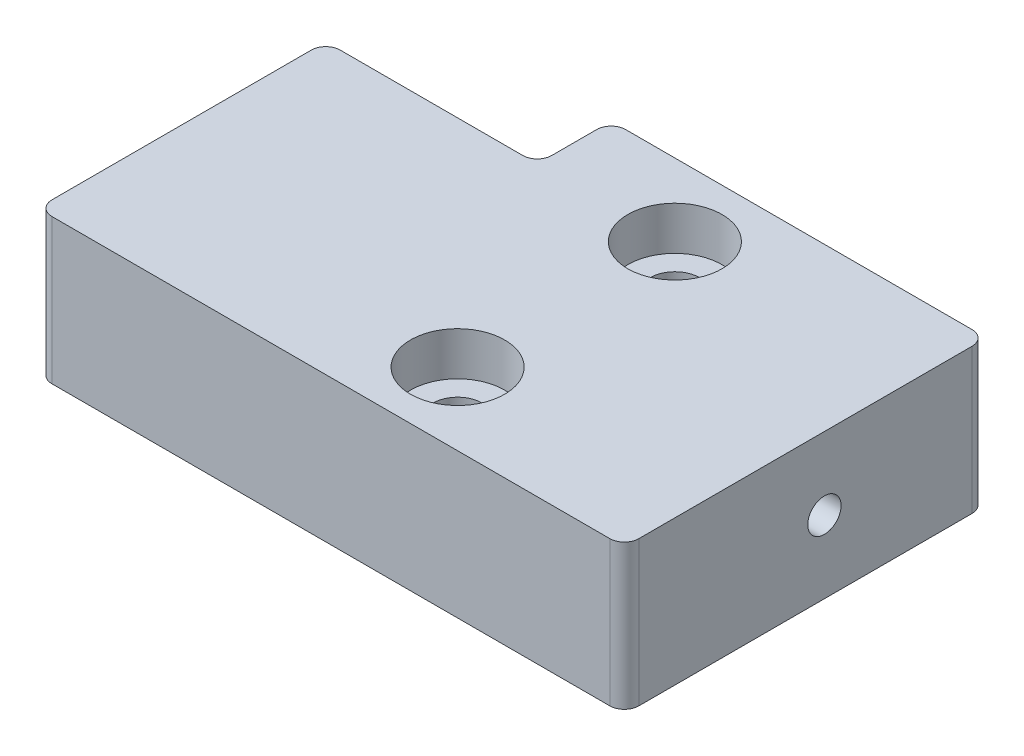
ISO-10303-21;
HEADER;
FILE_DESCRIPTION(('STEP AP214'),'2;1');
FILE_NAME('part.step','',(''),(''),'','','');
FILE_SCHEMA(('AUTOMOTIVE_DESIGN { 1 0 10303 214 1 1 1 1 }'));
ENDSEC;
DATA;
#1=APPLICATION_CONTEXT('core data for automotive mechanical design processes');
#2=APPLICATION_PROTOCOL_DEFINITION('international standard','automotive_design',2000,#1);
#3=PRODUCT_CONTEXT('',#1,'mechanical');
#4=PRODUCT('Part','Part','',(#3));
#5=PRODUCT_RELATED_PRODUCT_CATEGORY('part','',(#4));
#6=PRODUCT_DEFINITION_FORMATION('','',#4);
#7=PRODUCT_DEFINITION_CONTEXT('part definition',#1,'design');
#8=PRODUCT_DEFINITION('design','',#6,#7);
#9=PRODUCT_DEFINITION_SHAPE('','',#8);
#10=(LENGTH_UNIT() NAMED_UNIT(*) SI_UNIT(.MILLI.,.METRE.));
#11=(NAMED_UNIT(*) PLANE_ANGLE_UNIT() SI_UNIT($,.RADIAN.));
#12=(NAMED_UNIT(*) SI_UNIT($,.STERADIAN.) SOLID_ANGLE_UNIT());
#13=UNCERTAINTY_MEASURE_WITH_UNIT(LENGTH_MEASURE(1.E-05),#10,'distance_accuracy_value','');
#14=(GEOMETRIC_REPRESENTATION_CONTEXT(3) GLOBAL_UNCERTAINTY_ASSIGNED_CONTEXT((#13)) GLOBAL_UNIT_ASSIGNED_CONTEXT((#10,
#11,#12)) REPRESENTATION_CONTEXT('',''));
#15=CARTESIAN_POINT('',(0.,0.,0.));
#16=DIRECTION('',(0.,0.,1.));
#17=DIRECTION('',(1.,0.,0.));
#18=AXIS2_PLACEMENT_3D('',#15,#16,#17);
#19=CARTESIAN_POINT('',(0.,10.,-19.9));
#20=DIRECTION('',(1.,0.,0.));
#21=DIRECTION('',(0.,0.,-1.));
#22=AXIS2_PLACEMENT_3D('',#19,#20,#21);
#23=PLANE('',#22);
#24=DIRECTION('',(0.,0.,1.));
#25=VECTOR('',#24,1.);
#26=CARTESIAN_POINT('',(0.,10.,-19.9));
#27=LINE('',#26,#25);
#28=CARTESIAN_POINT('',(0.,10.,-18.9));
#29=VERTEX_POINT('',#28);
#30=CARTESIAN_POINT('',(0.,10.,-1.00000000000001));
#31=VERTEX_POINT('',#30);
#32=EDGE_CURVE('E150',#29,#31,#27,.T.);
#33=ORIENTED_EDGE('',*,*,#32,.F.);
#34=DIRECTION('',(0.,-1.,0.));
#35=VECTOR('',#34,1.);
#36=CARTESIAN_POINT('',(0.,10.,-18.9));
#37=LINE('',#36,#35);
#38=CARTESIAN_POINT('',(0.,0.,-18.9));
#39=VERTEX_POINT('',#38);
#40=EDGE_CURVE('E135',#29,#39,#37,.T.);
#41=ORIENTED_EDGE('',*,*,#40,.T.);
#42=DIRECTION('',(0.,0.,1.));
#43=VECTOR('',#42,1.);
#44=CARTESIAN_POINT('',(0.,0.,-19.9));
#45=LINE('',#44,#43);
#46=CARTESIAN_POINT('',(0.,0.,-1.00000000000001));
#47=VERTEX_POINT('',#46);
#48=EDGE_CURVE('E147',#39,#47,#45,.T.);
#49=ORIENTED_EDGE('',*,*,#48,.T.);
#50=DIRECTION('',(0.,-1.,0.));
#51=VECTOR('',#50,1.);
#52=CARTESIAN_POINT('',(0.,10.,-1.));
#53=LINE('',#52,#51);
#54=EDGE_CURVE('E152',#47,#31,#53,.F.);
#55=ORIENTED_EDGE('',*,*,#54,.T.);
#56=EDGE_LOOP('',(#33,#41,#49,#55));
#57=FACE_BOUND('',#56,.T.);
#58=ADVANCED_FACE('F40',(#57),#23,.F.);
#59=CARTESIAN_POINT('',(0.,10.,0.));
#60=DIRECTION('',(0.,0.,-1.));
#61=DIRECTION('',(-1.,0.,0.));
#62=AXIS2_PLACEMENT_3D('',#59,#60,#61);
#63=PLANE('',#62);
#64=DIRECTION('',(1.,0.,0.));
#65=VECTOR('',#64,1.);
#66=CARTESIAN_POINT('',(0.,0.,0.));
#67=LINE('',#66,#65);
#68=CARTESIAN_POINT('',(1.,0.,0.));
#69=VERTEX_POINT('',#68);
#70=CARTESIAN_POINT('',(39.51,0.,0.));
#71=VERTEX_POINT('',#70);
#72=EDGE_CURVE('E156',#69,#71,#67,.T.);
#73=ORIENTED_EDGE('',*,*,#72,.T.);
#74=DIRECTION('',(0.,-1.,0.));
#75=VECTOR('',#74,1.);
#76=CARTESIAN_POINT('',(39.51,10.,0.));
#77=LINE('',#76,#75);
#78=CARTESIAN_POINT('',(39.51,10.,0.));
#79=VERTEX_POINT('',#78);
#80=EDGE_CURVE('E214',#71,#79,#77,.F.);
#81=ORIENTED_EDGE('',*,*,#80,.T.);
#82=DIRECTION('',(1.,0.,0.));
#83=VECTOR('',#82,1.);
#84=CARTESIAN_POINT('',(0.,10.,0.));
#85=LINE('',#84,#83);
#86=CARTESIAN_POINT('',(1.,10.,0.));
#87=VERTEX_POINT('',#86);
#88=EDGE_CURVE('E235',#87,#79,#85,.T.);
#89=ORIENTED_EDGE('',*,*,#88,.F.);
#90=DIRECTION('',(0.,-1.,0.));
#91=VECTOR('',#90,1.);
#92=CARTESIAN_POINT('',(1.,10.,0.));
#93=LINE('',#92,#91);
#94=EDGE_CURVE('E211',#87,#69,#93,.T.);
#95=ORIENTED_EDGE('',*,*,#94,.T.);
#96=EDGE_LOOP('',(#73,#81,#89,#95));
#97=FACE_BOUND('',#96,.T.);
#98=ADVANCED_FACE('F284',(#97),#63,.F.);
#99=CARTESIAN_POINT('',(40.51,10.,0.));
#100=DIRECTION('',(-1.,0.,0.));
#101=DIRECTION('',(0.,0.,1.));
#102=AXIS2_PLACEMENT_3D('',#99,#100,#101);
#103=PLANE('',#102);
#104=CARTESIAN_POINT('',(40.51,4.99999999999972,-13.8099999999999));
#105=DIRECTION('',(-1.,0.,0.));
#106=DIRECTION('',(0.,0.,1.));
#107=AXIS2_PLACEMENT_3D('',#104,#105,#106);
#108=CIRCLE('',#107,1.15);
#109=CARTESIAN_POINT('',(40.51,4.99999999999972,-12.6599999999999));
#110=VERTEX_POINT('',#109);
#111=EDGE_CURVE('E44',#110,#110,#108,.T.);
#112=ORIENTED_EDGE('',*,*,#111,.T.);
#113=EDGE_LOOP('',(#112));
#114=FACE_BOUND('',#113,.T.);
#115=DIRECTION('',(0.,0.,-1.));
#116=VECTOR('',#115,1.);
#117=CARTESIAN_POINT('',(40.51,0.,0.));
#118=LINE('',#117,#116);
#119=CARTESIAN_POINT('',(40.51,0.,-1.));
#120=VERTEX_POINT('',#119);
#121=CARTESIAN_POINT('',(40.51,0.,-24.));
#122=VERTEX_POINT('',#121);
#123=EDGE_CURVE('E160',#120,#122,#118,.T.);
#124=ORIENTED_EDGE('',*,*,#123,.T.);
#125=DIRECTION('',(0.,-1.,0.));
#126=VECTOR('',#125,1.);
#127=CARTESIAN_POINT('',(40.51,10.,-24.));
#128=LINE('',#127,#126);
#129=CARTESIAN_POINT('',(40.51,10.,-24.));
#130=VERTEX_POINT('',#129);
#131=EDGE_CURVE('E209',#122,#130,#128,.F.);
#132=ORIENTED_EDGE('',*,*,#131,.T.);
#133=DIRECTION('',(0.,0.,-1.));
#134=VECTOR('',#133,1.);
#135=CARTESIAN_POINT('',(40.51,10.,0.));
#136=LINE('',#135,#134);
#137=CARTESIAN_POINT('',(40.51,10.,-1.));
#138=VERTEX_POINT('',#137);
#139=EDGE_CURVE('E230',#138,#130,#136,.T.);
#140=ORIENTED_EDGE('',*,*,#139,.F.);
#141=DIRECTION('',(0.,-1.,0.));
#142=VECTOR('',#141,1.);
#143=CARTESIAN_POINT('',(40.51,10.,-1.));
#144=LINE('',#143,#142);
#145=EDGE_CURVE('E206',#138,#120,#144,.T.);
#146=ORIENTED_EDGE('',*,*,#145,.T.);
#147=EDGE_LOOP('',(#124,#132,#140,#146));
#148=FACE_BOUND('',#147,.T.);
#149=ADVANCED_FACE('F266',(#114,#148),#103,.F.);
#150=CARTESIAN_POINT('',(40.51,10.,-25.));
#151=DIRECTION('',(0.,0.,1.));
#152=DIRECTION('',(1.,0.,0.));
#153=AXIS2_PLACEMENT_3D('',#150,#151,#152);
#154=PLANE('',#153);
#155=DIRECTION('',(-1.,0.,0.));
#156=VECTOR('',#155,1.);
#157=CARTESIAN_POINT('',(40.51,0.,-25.));
#158=LINE('',#157,#156);
#159=CARTESIAN_POINT('',(39.51,0.,-25.));
#160=VERTEX_POINT('',#159);
#161=CARTESIAN_POINT('',(15.6,0.,-25.));
#162=VERTEX_POINT('',#161);
#163=EDGE_CURVE('E171',#160,#162,#158,.T.);
#164=ORIENTED_EDGE('',*,*,#163,.T.);
#165=DIRECTION('',(0.,-1.,0.));
#166=VECTOR('',#165,1.);
#167=CARTESIAN_POINT('',(15.6,10.,-25.));
#168=LINE('',#167,#166);
#169=CARTESIAN_POINT('',(15.6,10.,-25.));
#170=VERTEX_POINT('',#169);
#171=EDGE_CURVE('E204',#162,#170,#168,.F.);
#172=ORIENTED_EDGE('',*,*,#171,.T.);
#173=DIRECTION('',(-1.,0.,0.));
#174=VECTOR('',#173,1.);
#175=CARTESIAN_POINT('',(40.51,10.,-25.));
#176=LINE('',#175,#174);
#177=CARTESIAN_POINT('',(39.51,10.,-25.));
#178=VERTEX_POINT('',#177);
#179=EDGE_CURVE('E229',#178,#170,#176,.T.);
#180=ORIENTED_EDGE('',*,*,#179,.F.);
#181=DIRECTION('',(0.,-1.,0.));
#182=VECTOR('',#181,1.);
#183=CARTESIAN_POINT('',(39.51,10.,-25.));
#184=LINE('',#183,#182);
#185=EDGE_CURVE('E201',#178,#160,#184,.T.);
#186=ORIENTED_EDGE('',*,*,#185,.T.);
#187=EDGE_LOOP('',(#164,#172,#180,#186));
#188=FACE_BOUND('',#187,.T.);
#189=ADVANCED_FACE('F323',(#188),#154,.F.);
#190=CARTESIAN_POINT('',(14.6,10.,-25.));
#191=DIRECTION('',(1.,0.,0.));
#192=DIRECTION('',(0.,0.,-1.));
#193=AXIS2_PLACEMENT_3D('',#190,#191,#192);
#194=PLANE('',#193);
#195=DIRECTION('',(0.,0.,1.));
#196=VECTOR('',#195,1.);
#197=CARTESIAN_POINT('',(14.6,0.,-25.));
#198=LINE('',#197,#196);
#199=CARTESIAN_POINT('',(14.6,0.,-24.));
#200=VERTEX_POINT('',#199);
#201=CARTESIAN_POINT('',(14.6,0.,-20.9));
#202=VERTEX_POINT('',#201);
#203=EDGE_CURVE('E174',#200,#202,#198,.T.);
#204=ORIENTED_EDGE('',*,*,#203,.T.);
#205=DIRECTION('',(0.,-1.,0.));
#206=VECTOR('',#205,1.);
#207=CARTESIAN_POINT('',(14.6,10.,-20.9));
#208=LINE('',#207,#206);
#209=CARTESIAN_POINT('',(14.6,10.,-20.9));
#210=VERTEX_POINT('',#209);
#211=EDGE_CURVE('E56',#202,#210,#208,.F.);
#212=ORIENTED_EDGE('',*,*,#211,.T.);
#213=DIRECTION('',(0.,0.,1.));
#214=VECTOR('',#213,1.);
#215=CARTESIAN_POINT('',(14.6,10.,-25.));
#216=LINE('',#215,#214);
#217=CARTESIAN_POINT('',(14.6,10.,-24.));
#218=VERTEX_POINT('',#217);
#219=EDGE_CURVE('E226',#218,#210,#216,.T.);
#220=ORIENTED_EDGE('',*,*,#219,.F.);
#221=DIRECTION('',(0.,-1.,0.));
#222=VECTOR('',#221,1.);
#223=CARTESIAN_POINT('',(14.6,10.,-24.));
#224=LINE('',#223,#222);
#225=EDGE_CURVE('E197',#218,#200,#224,.T.);
#226=ORIENTED_EDGE('',*,*,#225,.T.);
#227=EDGE_LOOP('',(#204,#212,#220,#226));
#228=FACE_BOUND('',#227,.T.);
#229=ADVANCED_FACE('F219',(#228),#194,.F.);
#230=CARTESIAN_POINT('',(14.6,10.,-19.9));
#231=DIRECTION('',(0.,0.,1.));
#232=DIRECTION('',(1.,0.,0.));
#233=AXIS2_PLACEMENT_3D('',#230,#231,#232);
#234=PLANE('',#233);
#235=DIRECTION('',(-1.,0.,0.));
#236=VECTOR('',#235,1.);
#237=CARTESIAN_POINT('',(14.6,0.,-19.9));
#238=LINE('',#237,#236);
#239=CARTESIAN_POINT('',(13.6,0.,-19.9));
#240=VERTEX_POINT('',#239);
#241=CARTESIAN_POINT('',(0.999999999999997,0.,-19.9));
#242=VERTEX_POINT('',#241);
#243=EDGE_CURVE('E176',#240,#242,#238,.T.);
#244=ORIENTED_EDGE('',*,*,#243,.T.);
#245=DIRECTION('',(0.,-1.,0.));
#246=VECTOR('',#245,1.);
#247=CARTESIAN_POINT('',(0.999999999999997,10.,-19.9));
#248=LINE('',#247,#246);
#249=CARTESIAN_POINT('',(0.999999999999997,10.,-19.9));
#250=VERTEX_POINT('',#249);
#251=EDGE_CURVE('E136',#242,#250,#248,.F.);
#252=ORIENTED_EDGE('',*,*,#251,.T.);
#253=DIRECTION('',(-1.,0.,0.));
#254=VECTOR('',#253,1.);
#255=CARTESIAN_POINT('',(14.6,10.,-19.9));
#256=LINE('',#255,#254);
#257=CARTESIAN_POINT('',(13.6,10.,-19.9));
#258=VERTEX_POINT('',#257);
#259=EDGE_CURVE('E166',#258,#250,#256,.T.);
#260=ORIENTED_EDGE('',*,*,#259,.F.);
#261=DIRECTION('',(0.,-1.,0.));
#262=VECTOR('',#261,1.);
#263=CARTESIAN_POINT('',(13.6,0.,-19.9));
#264=LINE('',#263,#262);
#265=EDGE_CURVE('E141',#258,#240,#264,.T.);
#266=ORIENTED_EDGE('',*,*,#265,.T.);
#267=EDGE_LOOP('',(#244,#252,#260,#266));
#268=FACE_BOUND('',#267,.T.);
#269=ADVANCED_FACE('F228',(#268),#234,.F.);
#270=CARTESIAN_POINT('',(0.,10.,0.));
#271=DIRECTION('',(0.,1.,0.));
#272=DIRECTION('',(0.,0.,1.));
#273=AXIS2_PLACEMENT_3D('',#270,#271,#272);
#274=PLANE('',#273);
#275=CARTESIAN_POINT('',(24.,10.,-20.));
#276=DIRECTION('',(0.,1.,0.));
#277=DIRECTION('',(0.,0.,1.));
#278=AXIS2_PLACEMENT_3D('',#275,#276,#277);
#279=CIRCLE('',#278,3.25);
#280=CARTESIAN_POINT('',(24.,10.,-16.75));
#281=VERTEX_POINT('',#280);
#282=EDGE_CURVE('E256',#281,#281,#279,.T.);
#283=ORIENTED_EDGE('',*,*,#282,.F.);
#284=EDGE_LOOP('',(#283));
#285=FACE_BOUND('',#284,.T.);
#286=CARTESIAN_POINT('',(24.,10.,-5.));
#287=DIRECTION('',(0.,1.,0.));
#288=DIRECTION('',(0.,0.,1.));
#289=AXIS2_PLACEMENT_3D('',#286,#287,#288);
#290=CIRCLE('',#289,3.25);
#291=CARTESIAN_POINT('',(24.,10.,-1.75000000000001));
#292=VERTEX_POINT('',#291);
#293=EDGE_CURVE('E244',#292,#292,#290,.T.);
#294=ORIENTED_EDGE('',*,*,#293,.F.);
#295=EDGE_LOOP('',(#294));
#296=FACE_BOUND('',#295,.T.);
#297=ORIENTED_EDGE('',*,*,#259,.T.);
#298=CARTESIAN_POINT('',(0.999999999999998,10.,-18.9));
#299=DIRECTION('',(0.,1.,0.));
#300=DIRECTION('',(0.,0.,1.));
#301=AXIS2_PLACEMENT_3D('',#298,#299,#300);
#302=CIRCLE('',#301,1.);
#303=EDGE_CURVE('E195',#250,#29,#302,.T.);
#304=ORIENTED_EDGE('',*,*,#303,.T.);
#305=ORIENTED_EDGE('',*,*,#32,.T.);
#306=CARTESIAN_POINT('',(1.,10.,-1.));
#307=DIRECTION('',(0.,1.,0.));
#308=DIRECTION('',(0.,0.,1.));
#309=AXIS2_PLACEMENT_3D('',#306,#307,#308);
#310=CIRCLE('',#309,1.);
#311=EDGE_CURVE('E188',#31,#87,#310,.T.);
#312=ORIENTED_EDGE('',*,*,#311,.T.);
#313=ORIENTED_EDGE('',*,*,#88,.T.);
#314=CARTESIAN_POINT('',(39.51,10.,-1.));
#315=DIRECTION('',(0.,1.,0.));
#316=DIRECTION('',(0.,0.,1.));
#317=AXIS2_PLACEMENT_3D('',#314,#315,#316);
#318=CIRCLE('',#317,1.);
#319=EDGE_CURVE('E190',#79,#138,#318,.T.);
#320=ORIENTED_EDGE('',*,*,#319,.T.);
#321=ORIENTED_EDGE('',*,*,#139,.T.);
#322=CARTESIAN_POINT('',(39.51,10.,-24.));
#323=DIRECTION('',(0.,1.,0.));
#324=DIRECTION('',(0.,0.,1.));
#325=AXIS2_PLACEMENT_3D('',#322,#323,#324);
#326=CIRCLE('',#325,1.);
#327=EDGE_CURVE('E192',#130,#178,#326,.T.);
#328=ORIENTED_EDGE('',*,*,#327,.T.);
#329=ORIENTED_EDGE('',*,*,#179,.T.);
#330=CARTESIAN_POINT('',(15.6,10.,-24.));
#331=DIRECTION('',(0.,1.,0.));
#332=DIRECTION('',(0.,0.,1.));
#333=AXIS2_PLACEMENT_3D('',#330,#331,#332);
#334=CIRCLE('',#333,1.);
#335=EDGE_CURVE('E63',#170,#218,#334,.T.);
#336=ORIENTED_EDGE('',*,*,#335,.T.);
#337=ORIENTED_EDGE('',*,*,#219,.T.);
#338=CARTESIAN_POINT('',(13.6,10.,-20.9));
#339=DIRECTION('',(0.,1.,0.));
#340=DIRECTION('',(0.,0.,1.));
#341=AXIS2_PLACEMENT_3D('',#338,#339,#340);
#342=CIRCLE('',#341,1.);
#343=EDGE_CURVE('E11',#210,#258,#342,.F.);
#344=ORIENTED_EDGE('',*,*,#343,.T.);
#345=EDGE_LOOP('',(#297,#304,#305,#312,#313,#320,#321,#328,#329,#336,#337,#344));
#346=FACE_BOUND('',#345,.T.);
#347=ADVANCED_FACE('F225',(#285,#296,#346),#274,.T.);
#348=CARTESIAN_POINT('',(0.,0.,0.));
#349=DIRECTION('',(0.,1.,0.));
#350=DIRECTION('',(0.,0.,1.));
#351=AXIS2_PLACEMENT_3D('',#348,#349,#350);
#352=PLANE('',#351);
#353=CARTESIAN_POINT('',(24.,0.,-20.));
#354=DIRECTION('',(0.,1.,0.));
#355=DIRECTION('',(0.,0.,1.));
#356=AXIS2_PLACEMENT_3D('',#353,#354,#355);
#357=CIRCLE('',#356,1.7);
#358=CARTESIAN_POINT('',(24.,0.,-18.3));
#359=VERTEX_POINT('',#358);
#360=EDGE_CURVE('E247',#359,#359,#357,.T.);
#361=ORIENTED_EDGE('',*,*,#360,.T.);
#362=EDGE_LOOP('',(#361));
#363=FACE_BOUND('',#362,.T.);
#364=CARTESIAN_POINT('',(24.,0.,-5.));
#365=DIRECTION('',(0.,1.,0.));
#366=DIRECTION('',(0.,0.,1.));
#367=AXIS2_PLACEMENT_3D('',#364,#365,#366);
#368=CIRCLE('',#367,1.7);
#369=CARTESIAN_POINT('',(24.,0.,-3.3));
#370=VERTEX_POINT('',#369);
#371=EDGE_CURVE('E157',#370,#370,#368,.T.);
#372=ORIENTED_EDGE('',*,*,#371,.T.);
#373=EDGE_LOOP('',(#372));
#374=FACE_BOUND('',#373,.T.);
#375=ORIENTED_EDGE('',*,*,#48,.F.);
#376=CARTESIAN_POINT('',(0.999999999999998,0.,-18.9));
#377=DIRECTION('',(0.,1.,0.));
#378=DIRECTION('',(0.,0.,1.));
#379=AXIS2_PLACEMENT_3D('',#376,#377,#378);
#380=CIRCLE('',#379,1.);
#381=EDGE_CURVE('E131',#39,#242,#380,.F.);
#382=ORIENTED_EDGE('',*,*,#381,.T.);
#383=ORIENTED_EDGE('',*,*,#243,.F.);
#384=CARTESIAN_POINT('',(13.6,0.,-20.9));
#385=DIRECTION('',(0.,1.,0.));
#386=DIRECTION('',(0.,0.,1.));
#387=AXIS2_PLACEMENT_3D('',#384,#385,#386);
#388=CIRCLE('',#387,1.);
#389=EDGE_CURVE('E49',#240,#202,#388,.T.);
#390=ORIENTED_EDGE('',*,*,#389,.T.);
#391=ORIENTED_EDGE('',*,*,#203,.F.);
#392=CARTESIAN_POINT('',(15.6,0.,-24.));
#393=DIRECTION('',(0.,1.,0.));
#394=DIRECTION('',(0.,0.,1.));
#395=AXIS2_PLACEMENT_3D('',#392,#393,#394);
#396=CIRCLE('',#395,1.);
#397=EDGE_CURVE('E142',#200,#162,#396,.F.);
#398=ORIENTED_EDGE('',*,*,#397,.T.);
#399=ORIENTED_EDGE('',*,*,#163,.F.);
#400=CARTESIAN_POINT('',(39.51,0.,-24.));
#401=DIRECTION('',(0.,1.,0.));
#402=DIRECTION('',(0.,0.,1.));
#403=AXIS2_PLACEMENT_3D('',#400,#401,#402);
#404=CIRCLE('',#403,1.);
#405=EDGE_CURVE('E182',#160,#122,#404,.F.);
#406=ORIENTED_EDGE('',*,*,#405,.T.);
#407=ORIENTED_EDGE('',*,*,#123,.F.);
#408=CARTESIAN_POINT('',(39.51,0.,-1.));
#409=DIRECTION('',(0.,1.,0.));
#410=DIRECTION('',(0.,0.,1.));
#411=AXIS2_PLACEMENT_3D('',#408,#409,#410);
#412=CIRCLE('',#411,1.);
#413=EDGE_CURVE('E180',#120,#71,#412,.F.);
#414=ORIENTED_EDGE('',*,*,#413,.T.);
#415=ORIENTED_EDGE('',*,*,#72,.F.);
#416=CARTESIAN_POINT('',(1.,0.,-1.));
#417=DIRECTION('',(0.,1.,0.));
#418=DIRECTION('',(0.,0.,1.));
#419=AXIS2_PLACEMENT_3D('',#416,#417,#418);
#420=CIRCLE('',#419,1.);
#421=EDGE_CURVE('E151',#69,#47,#420,.F.);
#422=ORIENTED_EDGE('',*,*,#421,.T.);
#423=EDGE_LOOP('',(#375,#382,#383,#390,#391,#398,#399,#406,#407,#414,#415,#422));
#424=FACE_BOUND('',#423,.T.);
#425=ADVANCED_FACE('F154',(#363,#374,#424),#352,.F.);
#426=CARTESIAN_POINT('',(0.999999999999998,10.,-18.9));
#427=DIRECTION('',(0.,-1.,0.));
#428=DIRECTION('',(0.,0.,-1.));
#429=AXIS2_PLACEMENT_3D('',#426,#427,#428);
#430=CYLINDRICAL_SURFACE('',#429,1.);
#431=ORIENTED_EDGE('',*,*,#303,.F.);
#432=ORIENTED_EDGE('',*,*,#251,.F.);
#433=ORIENTED_EDGE('',*,*,#381,.F.);
#434=ORIENTED_EDGE('',*,*,#40,.F.);
#435=EDGE_LOOP('',(#431,#432,#433,#434));
#436=FACE_BOUND('',#435,.T.);
#437=ADVANCED_FACE('F134',(#436),#430,.T.);
#438=CARTESIAN_POINT('',(13.6,10.,-20.9));
#439=DIRECTION('',(0.,1.,0.));
#440=DIRECTION('',(0.,0.,1.));
#441=AXIS2_PLACEMENT_3D('',#438,#439,#440);
#442=CYLINDRICAL_SURFACE('',#441,1.);
#443=ORIENTED_EDGE('',*,*,#343,.F.);
#444=ORIENTED_EDGE('',*,*,#211,.F.);
#445=ORIENTED_EDGE('',*,*,#389,.F.);
#446=ORIENTED_EDGE('',*,*,#265,.F.);
#447=EDGE_LOOP('',(#443,#444,#445,#446));
#448=FACE_BOUND('',#447,.T.);
#449=ADVANCED_FACE('F222',(#448),#442,.F.);
#450=CARTESIAN_POINT('',(15.6,10.,-24.));
#451=DIRECTION('',(0.,-1.,0.));
#452=DIRECTION('',(0.,0.,-1.));
#453=AXIS2_PLACEMENT_3D('',#450,#451,#452);
#454=CYLINDRICAL_SURFACE('',#453,1.);
#455=ORIENTED_EDGE('',*,*,#335,.F.);
#456=ORIENTED_EDGE('',*,*,#171,.F.);
#457=ORIENTED_EDGE('',*,*,#397,.F.);
#458=ORIENTED_EDGE('',*,*,#225,.F.);
#459=EDGE_LOOP('',(#455,#456,#457,#458));
#460=FACE_BOUND('',#459,.T.);
#461=ADVANCED_FACE('F297',(#460),#454,.T.);
#462=CARTESIAN_POINT('',(39.51,10.,-24.));
#463=DIRECTION('',(0.,-1.,0.));
#464=DIRECTION('',(0.,0.,-1.));
#465=AXIS2_PLACEMENT_3D('',#462,#463,#464);
#466=CYLINDRICAL_SURFACE('',#465,1.);
#467=ORIENTED_EDGE('',*,*,#327,.F.);
#468=ORIENTED_EDGE('',*,*,#131,.F.);
#469=ORIENTED_EDGE('',*,*,#405,.F.);
#470=ORIENTED_EDGE('',*,*,#185,.F.);
#471=EDGE_LOOP('',(#467,#468,#469,#470));
#472=FACE_BOUND('',#471,.T.);
#473=ADVANCED_FACE('F300',(#472),#466,.T.);
#474=CARTESIAN_POINT('',(39.51,10.,-1.));
#475=DIRECTION('',(0.,-1.,0.));
#476=DIRECTION('',(0.,0.,-1.));
#477=AXIS2_PLACEMENT_3D('',#474,#475,#476);
#478=CYLINDRICAL_SURFACE('',#477,1.);
#479=ORIENTED_EDGE('',*,*,#319,.F.);
#480=ORIENTED_EDGE('',*,*,#80,.F.);
#481=ORIENTED_EDGE('',*,*,#413,.F.);
#482=ORIENTED_EDGE('',*,*,#145,.F.);
#483=EDGE_LOOP('',(#479,#480,#481,#482));
#484=FACE_BOUND('',#483,.T.);
#485=ADVANCED_FACE('F303',(#484),#478,.T.);
#486=CARTESIAN_POINT('',(1.,10.,-1.));
#487=DIRECTION('',(0.,-1.,0.));
#488=DIRECTION('',(0.,0.,-1.));
#489=AXIS2_PLACEMENT_3D('',#486,#487,#488);
#490=CYLINDRICAL_SURFACE('',#489,1.);
#491=ORIENTED_EDGE('',*,*,#311,.F.);
#492=ORIENTED_EDGE('',*,*,#54,.F.);
#493=ORIENTED_EDGE('',*,*,#421,.F.);
#494=ORIENTED_EDGE('',*,*,#94,.F.);
#495=EDGE_LOOP('',(#491,#492,#493,#494));
#496=FACE_BOUND('',#495,.T.);
#497=ADVANCED_FACE('F42',(#496),#490,.T.);
#498=CARTESIAN_POINT('',(24.,10.,-5.));
#499=DIRECTION('',(0.,1.,0.));
#500=DIRECTION('',(0.,0.,1.));
#501=AXIS2_PLACEMENT_3D('',#498,#499,#500);
#502=CYLINDRICAL_SURFACE('',#501,1.7);
#503=ORIENTED_EDGE('',*,*,#371,.F.);
#504=EDGE_LOOP('',(#503));
#505=FACE_BOUND('',#504,.T.);
#506=CARTESIAN_POINT('',(24.,7.,-5.));
#507=DIRECTION('',(0.,1.,0.));
#508=DIRECTION('',(0.,0.,1.));
#509=AXIS2_PLACEMENT_3D('',#506,#507,#508);
#510=CIRCLE('',#509,1.7);
#511=CARTESIAN_POINT('',(24.,7.,-3.3));
#512=VERTEX_POINT('',#511);
#513=EDGE_CURVE('E163',#512,#512,#510,.T.);
#514=ORIENTED_EDGE('',*,*,#513,.T.);
#515=EDGE_LOOP('',(#514));
#516=FACE_BOUND('',#515,.T.);
#517=ADVANCED_FACE('F310',(#505,#516),#502,.F.);
#518=CARTESIAN_POINT('',(25.7,7.,-5.));
#519=DIRECTION('',(0.,-1.,0.));
#520=DIRECTION('',(0.,0.,-1.));
#521=AXIS2_PLACEMENT_3D('',#518,#519,#520);
#522=PLANE('',#521);
#523=ORIENTED_EDGE('',*,*,#513,.F.);
#524=EDGE_LOOP('',(#523));
#525=FACE_BOUND('',#524,.T.);
#526=CARTESIAN_POINT('',(24.,7.,-5.));
#527=DIRECTION('',(0.,1.,0.));
#528=DIRECTION('',(0.,0.,1.));
#529=AXIS2_PLACEMENT_3D('',#526,#527,#528);
#530=CIRCLE('',#529,3.25);
#531=CARTESIAN_POINT('',(24.,7.,-1.75000000000001));
#532=VERTEX_POINT('',#531);
#533=EDGE_CURVE('E241',#532,#532,#530,.T.);
#534=ORIENTED_EDGE('',*,*,#533,.T.);
#535=EDGE_LOOP('',(#534));
#536=FACE_BOUND('',#535,.T.);
#537=ADVANCED_FACE('F346',(#525,#536),#522,.F.);
#538=CARTESIAN_POINT('',(24.,10.,-5.));
#539=DIRECTION('',(0.,1.,0.));
#540=DIRECTION('',(0.,0.,1.));
#541=AXIS2_PLACEMENT_3D('',#538,#539,#540);
#542=CYLINDRICAL_SURFACE('',#541,3.25);
#543=ORIENTED_EDGE('',*,*,#533,.F.);
#544=EDGE_LOOP('',(#543));
#545=FACE_BOUND('',#544,.T.);
#546=ORIENTED_EDGE('',*,*,#293,.T.);
#547=EDGE_LOOP('',(#546));
#548=FACE_BOUND('',#547,.T.);
#549=ADVANCED_FACE('F350',(#545,#548),#542,.F.);
#550=CARTESIAN_POINT('',(24.,10.,-20.));
#551=DIRECTION('',(0.,1.,0.));
#552=DIRECTION('',(0.,0.,1.));
#553=AXIS2_PLACEMENT_3D('',#550,#551,#552);
#554=CYLINDRICAL_SURFACE('',#553,1.7);
#555=ORIENTED_EDGE('',*,*,#360,.F.);
#556=EDGE_LOOP('',(#555));
#557=FACE_BOUND('',#556,.T.);
#558=CARTESIAN_POINT('',(24.,7.,-20.));
#559=DIRECTION('',(0.,1.,0.));
#560=DIRECTION('',(0.,0.,1.));
#561=AXIS2_PLACEMENT_3D('',#558,#559,#560);
#562=CIRCLE('',#561,1.7);
#563=CARTESIAN_POINT('',(24.,7.,-18.3));
#564=VERTEX_POINT('',#563);
#565=EDGE_CURVE('E250',#564,#564,#562,.T.);
#566=ORIENTED_EDGE('',*,*,#565,.T.);
#567=EDGE_LOOP('',(#566));
#568=FACE_BOUND('',#567,.T.);
#569=ADVANCED_FACE('F354',(#557,#568),#554,.F.);
#570=CARTESIAN_POINT('',(25.7,7.,-20.));
#571=DIRECTION('',(0.,-1.,0.));
#572=DIRECTION('',(0.,0.,-1.));
#573=AXIS2_PLACEMENT_3D('',#570,#571,#572);
#574=PLANE('',#573);
#575=ORIENTED_EDGE('',*,*,#565,.F.);
#576=EDGE_LOOP('',(#575));
#577=FACE_BOUND('',#576,.T.);
#578=CARTESIAN_POINT('',(24.,7.,-20.));
#579=DIRECTION('',(0.,1.,0.));
#580=DIRECTION('',(0.,0.,1.));
#581=AXIS2_PLACEMENT_3D('',#578,#579,#580);
#582=CIRCLE('',#581,3.25);
#583=CARTESIAN_POINT('',(24.,7.,-16.75));
#584=VERTEX_POINT('',#583);
#585=EDGE_CURVE('E253',#584,#584,#582,.T.);
#586=ORIENTED_EDGE('',*,*,#585,.T.);
#587=EDGE_LOOP('',(#586));
#588=FACE_BOUND('',#587,.T.);
#589=ADVANCED_FACE('F280',(#577,#588),#574,.F.);
#590=CARTESIAN_POINT('',(24.,10.,-20.));
#591=DIRECTION('',(0.,1.,0.));
#592=DIRECTION('',(0.,0.,1.));
#593=AXIS2_PLACEMENT_3D('',#590,#591,#592);
#594=CYLINDRICAL_SURFACE('',#593,3.25);
#595=ORIENTED_EDGE('',*,*,#585,.F.);
#596=EDGE_LOOP('',(#595));
#597=FACE_BOUND('',#596,.T.);
#598=ORIENTED_EDGE('',*,*,#282,.T.);
#599=EDGE_LOOP('',(#598));
#600=FACE_BOUND('',#599,.T.);
#601=ADVANCED_FACE('F272',(#597,#600),#594,.F.);
#602=CARTESIAN_POINT('',(38.01,4.99999999999972,-13.8099999999999));
#603=DIRECTION('',(1.,0.,0.));
#604=DIRECTION('',(0.,0.,-1.));
#605=AXIS2_PLACEMENT_3D('',#602,#603,#604);
#606=CYLINDRICAL_SURFACE('',#605,1.15);
#607=CARTESIAN_POINT('',(38.01,4.99999999999972,-13.8099999999999));
#608=DIRECTION('',(1.,0.,0.));
#609=DIRECTION('',(0.,0.,-1.));
#610=AXIS2_PLACEMENT_3D('',#607,#608,#609);
#611=CIRCLE('',#610,1.15);
#612=CARTESIAN_POINT('',(38.01,4.99999999999972,-14.9599999999999));
#613=VERTEX_POINT('',#612);
#614=EDGE_CURVE('E259',#613,#613,#611,.T.);
#615=ORIENTED_EDGE('',*,*,#614,.F.);
#616=EDGE_LOOP('',(#615));
#617=FACE_BOUND('',#616,.T.);
#618=ORIENTED_EDGE('',*,*,#111,.F.);
#619=EDGE_LOOP('',(#618));
#620=FACE_BOUND('',#619,.T.);
#621=ADVANCED_FACE('F269',(#617,#620),#606,.F.);
#622=CARTESIAN_POINT('',(38.01,4.99999999999972,-13.8099999999999));
#623=DIRECTION('',(1.,0.,0.));
#624=DIRECTION('',(0.,0.,-1.));
#625=AXIS2_PLACEMENT_3D('',#622,#623,#624);
#626=PLANE('',#625);
#627=ORIENTED_EDGE('',*,*,#614,.T.);
#628=EDGE_LOOP('',(#627));
#629=FACE_BOUND('',#628,.T.);
#630=ADVANCED_FACE('F271',(#629),#626,.T.);
#631=CLOSED_SHELL('',(#58,#98,#149,#189,#229,#269,#347,#425,#437,#449,#461,#473,#485,#497,#517,
#537,#549,#569,#589,#601,#621,#630));
#632=MANIFOLD_SOLID_BREP('B2',#631);
#633=ADVANCED_BREP_SHAPE_REPRESENTATION('',(#18,#632),#14);
#634=SHAPE_DEFINITION_REPRESENTATION(#9,#633);
ENDSEC;
END-ISO-10303-21;
